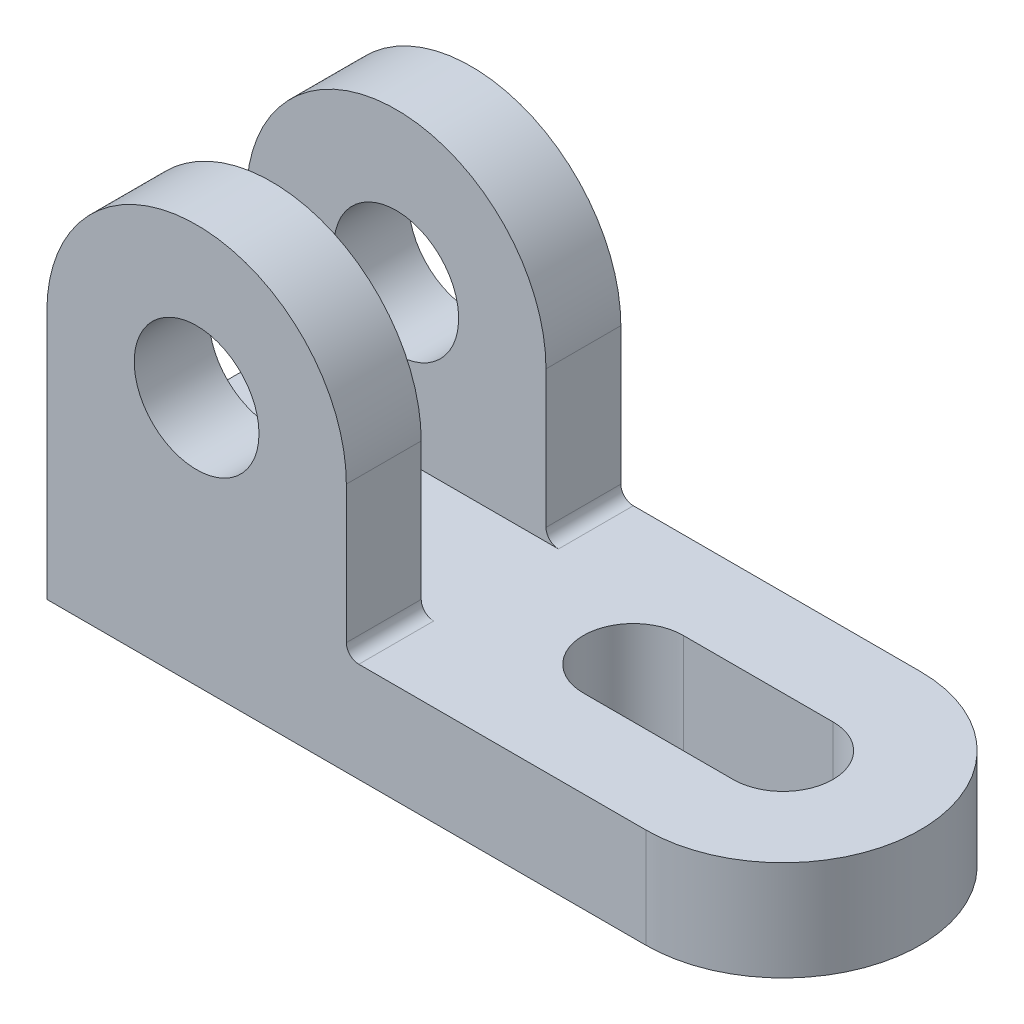
ISO-10303-21;
HEADER;
FILE_DESCRIPTION(('STEP AP214'),'2;1');
FILE_NAME('part.step','',(''),(''),'','','');
FILE_SCHEMA(('AUTOMOTIVE_DESIGN { 1 0 10303 214 1 1 1 1 }'));
ENDSEC;
DATA;
#1=APPLICATION_CONTEXT('core data for automotive mechanical design processes');
#2=APPLICATION_PROTOCOL_DEFINITION('international standard','automotive_design',2000,#1);
#3=PRODUCT_CONTEXT('',#1,'mechanical');
#4=PRODUCT('Part','Part','',(#3));
#5=PRODUCT_RELATED_PRODUCT_CATEGORY('part','',(#4));
#6=PRODUCT_DEFINITION_FORMATION('','',#4);
#7=PRODUCT_DEFINITION_CONTEXT('part definition',#1,'design');
#8=PRODUCT_DEFINITION('design','',#6,#7);
#9=PRODUCT_DEFINITION_SHAPE('','',#8);
#10=(LENGTH_UNIT() NAMED_UNIT(*) SI_UNIT(.MILLI.,.METRE.));
#11=(NAMED_UNIT(*) PLANE_ANGLE_UNIT() SI_UNIT($,.RADIAN.));
#12=(NAMED_UNIT(*) SI_UNIT($,.STERADIAN.) SOLID_ANGLE_UNIT());
#13=UNCERTAINTY_MEASURE_WITH_UNIT(LENGTH_MEASURE(1.E-05),#10,'distance_accuracy_value','');
#14=(GEOMETRIC_REPRESENTATION_CONTEXT(3) GLOBAL_UNCERTAINTY_ASSIGNED_CONTEXT((#13)) GLOBAL_UNIT_ASSIGNED_CONTEXT((#10,
#11,#12)) REPRESENTATION_CONTEXT('',''));
#15=CARTESIAN_POINT('',(0.,0.,0.));
#16=DIRECTION('',(0.,0.,1.));
#17=DIRECTION('',(1.,0.,0.));
#18=AXIS2_PLACEMENT_3D('',#15,#16,#17);
#19=CARTESIAN_POINT('',(48.,16.,0.));
#20=DIRECTION('',(0.,-1.,0.));
#21=DIRECTION('',(0.,0.,-1.));
#22=AXIS2_PLACEMENT_3D('',#19,#20,#21);
#23=CYLINDRICAL_SURFACE('',#22,22.);
#24=CARTESIAN_POINT('',(48.,0.,0.));
#25=DIRECTION('',(0.,1.,0.));
#26=DIRECTION('',(0.,0.,1.));
#27=AXIS2_PLACEMENT_3D('',#24,#25,#26);
#28=CIRCLE('',#27,22.);
#29=CARTESIAN_POINT('',(48.,0.,22.));
#30=VERTEX_POINT('',#29);
#31=CARTESIAN_POINT('',(48.,0.,-22.));
#32=VERTEX_POINT('',#31);
#33=EDGE_CURVE('E300',#30,#32,#28,.T.);
#34=ORIENTED_EDGE('',*,*,#33,.T.);
#35=DIRECTION('',(0.,-1.,0.));
#36=VECTOR('',#35,1.);
#37=CARTESIAN_POINT('',(48.,16.,-22.));
#38=LINE('',#37,#36);
#39=CARTESIAN_POINT('',(48.,16.,-22.));
#40=VERTEX_POINT('',#39);
#41=EDGE_CURVE('E11',#40,#32,#38,.T.);
#42=ORIENTED_EDGE('',*,*,#41,.F.);
#43=CARTESIAN_POINT('',(48.,16.,0.));
#44=DIRECTION('',(0.,1.,0.));
#45=DIRECTION('',(0.,0.,1.));
#46=AXIS2_PLACEMENT_3D('',#43,#44,#45);
#47=CIRCLE('',#46,22.);
#48=CARTESIAN_POINT('',(48.,16.,22.));
#49=VERTEX_POINT('',#48);
#50=EDGE_CURVE('E310',#49,#40,#47,.T.);
#51=ORIENTED_EDGE('',*,*,#50,.F.);
#52=DIRECTION('',(0.,-1.,0.));
#53=VECTOR('',#52,1.);
#54=CARTESIAN_POINT('',(48.,16.,22.));
#55=LINE('',#54,#53);
#56=EDGE_CURVE('E323',#49,#30,#55,.T.);
#57=ORIENTED_EDGE('',*,*,#56,.T.);
#58=EDGE_LOOP('',(#34,#42,#51,#57));
#59=FACE_BOUND('',#58,.T.);
#60=ADVANCED_FACE('F45',(#59),#23,.T.);
#61=CARTESIAN_POINT('',(-48.,16.,-22.));
#62=DIRECTION('',(0.,0.,1.));
#63=DIRECTION('',(1.,0.,0.));
#64=AXIS2_PLACEMENT_3D('',#61,#62,#63);
#65=PLANE('',#64);
#66=DIRECTION('',(-1.,0.,0.));
#67=VECTOR('',#66,1.);
#68=CARTESIAN_POINT('',(-48.,0.,-22.));
#69=LINE('',#68,#67);
#70=CARTESIAN_POINT('',(-48.,0.,-22.));
#71=VERTEX_POINT('',#70);
#72=EDGE_CURVE('E327',#32,#71,#69,.T.);
#73=ORIENTED_EDGE('',*,*,#72,.T.);
#74=DIRECTION('',(0.,-1.,0.));
#75=VECTOR('',#74,1.);
#76=CARTESIAN_POINT('',(-48.,16.,-22.));
#77=LINE('',#76,#75);
#78=CARTESIAN_POINT('',(-48.,40.,-22.));
#79=VERTEX_POINT('',#78);
#80=EDGE_CURVE('E53',#79,#71,#77,.T.);
#81=ORIENTED_EDGE('',*,*,#80,.F.);
#82=CARTESIAN_POINT('',(-24.,40.,-22.));
#83=DIRECTION('',(0.,0.,-1.));
#84=DIRECTION('',(-1.,0.,0.));
#85=AXIS2_PLACEMENT_3D('',#82,#83,#84);
#86=CIRCLE('',#85,24.);
#87=CARTESIAN_POINT('',(0.,40.,-22.));
#88=VERTEX_POINT('',#87);
#89=EDGE_CURVE('E163',#79,#88,#86,.T.);
#90=ORIENTED_EDGE('',*,*,#89,.T.);
#91=DIRECTION('',(0.,-1.,0.));
#92=VECTOR('',#91,1.);
#93=CARTESIAN_POINT('',(0.,0.,-22.));
#94=LINE('',#93,#92);
#95=CARTESIAN_POINT('',(0.,18.,-22.));
#96=VERTEX_POINT('',#95);
#97=EDGE_CURVE('E200',#88,#96,#94,.T.);
#98=ORIENTED_EDGE('',*,*,#97,.T.);
#99=CARTESIAN_POINT('',(2.,18.,-22.));
#100=DIRECTION('',(0.,0.,-1.));
#101=DIRECTION('',(-1.,0.,0.));
#102=AXIS2_PLACEMENT_3D('',#99,#100,#101);
#103=CIRCLE('',#102,2.);
#104=CARTESIAN_POINT('',(1.99999999999999,16.,-22.));
#105=VERTEX_POINT('',#104);
#106=EDGE_CURVE('E194',#105,#96,#103,.T.);
#107=ORIENTED_EDGE('',*,*,#106,.F.);
#108=DIRECTION('',(-1.,0.,0.));
#109=VECTOR('',#108,1.);
#110=CARTESIAN_POINT('',(-48.,16.,-22.));
#111=LINE('',#110,#109);
#112=EDGE_CURVE('E314',#40,#105,#111,.T.);
#113=ORIENTED_EDGE('',*,*,#112,.F.);
#114=ORIENTED_EDGE('',*,*,#41,.T.);
#115=EDGE_LOOP('',(#73,#81,#90,#98,#107,#113,#114));
#116=FACE_BOUND('',#115,.T.);
#117=CARTESIAN_POINT('',(-24.,40.,-22.));
#118=DIRECTION('',(0.,0.,-1.));
#119=DIRECTION('',(-1.,0.,0.));
#120=AXIS2_PLACEMENT_3D('',#117,#118,#119);
#121=CIRCLE('',#120,10.);
#122=CARTESIAN_POINT('',(-34.,40.,-22.));
#123=VERTEX_POINT('',#122);
#124=EDGE_CURVE('E190',#123,#123,#121,.T.);
#125=ORIENTED_EDGE('',*,*,#124,.F.);
#126=EDGE_LOOP('',(#125));
#127=FACE_BOUND('',#126,.T.);
#128=ADVANCED_FACE('F389',(#116,#127),#65,.F.);
#129=CARTESIAN_POINT('',(-48.,16.,-22.));
#130=DIRECTION('',(1.,0.,0.));
#131=DIRECTION('',(0.,0.,-1.));
#132=AXIS2_PLACEMENT_3D('',#129,#130,#131);
#133=PLANE('',#132);
#134=DIRECTION('',(0.,0.,1.));
#135=VECTOR('',#134,1.);
#136=CARTESIAN_POINT('',(-48.,0.,-22.));
#137=LINE('',#136,#135);
#138=CARTESIAN_POINT('',(-48.,0.,22.));
#139=VERTEX_POINT('',#138);
#140=EDGE_CURVE('E330',#71,#139,#137,.T.);
#141=ORIENTED_EDGE('',*,*,#140,.T.);
#142=DIRECTION('',(0.,-1.,0.));
#143=VECTOR('',#142,1.);
#144=CARTESIAN_POINT('',(-48.,16.,22.));
#145=LINE('',#144,#143);
#146=CARTESIAN_POINT('',(-48.,40.,22.));
#147=VERTEX_POINT('',#146);
#148=EDGE_CURVE('E338',#147,#139,#145,.T.);
#149=ORIENTED_EDGE('',*,*,#148,.F.);
#150=DIRECTION('',(0.,0.,1.));
#151=VECTOR('',#150,1.);
#152=CARTESIAN_POINT('',(-48.,40.,9.99999999999999));
#153=LINE('',#152,#151);
#154=CARTESIAN_POINT('',(-48.,40.,9.99999999999999));
#155=VERTEX_POINT('',#154);
#156=EDGE_CURVE('E252',#155,#147,#153,.T.);
#157=ORIENTED_EDGE('',*,*,#156,.F.);
#158=DIRECTION('',(0.,1.,0.));
#159=VECTOR('',#158,1.);
#160=CARTESIAN_POINT('',(-48.,0.,9.99999999999999));
#161=LINE('',#160,#159);
#162=CARTESIAN_POINT('',(-48.,16.,10.));
#163=VERTEX_POINT('',#162);
#164=EDGE_CURVE('E234',#163,#155,#161,.T.);
#165=ORIENTED_EDGE('',*,*,#164,.F.);
#166=DIRECTION('',(0.,0.,1.));
#167=VECTOR('',#166,1.);
#168=CARTESIAN_POINT('',(-48.,16.,-22.));
#169=LINE('',#168,#167);
#170=CARTESIAN_POINT('',(-48.,16.,-10.));
#171=VERTEX_POINT('',#170);
#172=EDGE_CURVE('E180',#171,#163,#169,.T.);
#173=ORIENTED_EDGE('',*,*,#172,.F.);
#174=DIRECTION('',(0.,1.,0.));
#175=VECTOR('',#174,1.);
#176=CARTESIAN_POINT('',(-48.,0.,-10.));
#177=LINE('',#176,#175);
#178=CARTESIAN_POINT('',(-48.,40.,-10.));
#179=VERTEX_POINT('',#178);
#180=EDGE_CURVE('E173',#171,#179,#177,.T.);
#181=ORIENTED_EDGE('',*,*,#180,.T.);
#182=DIRECTION('',(0.,0.,-1.));
#183=VECTOR('',#182,1.);
#184=CARTESIAN_POINT('',(-48.,40.,-10.));
#185=LINE('',#184,#183);
#186=EDGE_CURVE('E157',#179,#79,#185,.T.);
#187=ORIENTED_EDGE('',*,*,#186,.T.);
#188=ORIENTED_EDGE('',*,*,#80,.T.);
#189=EDGE_LOOP('',(#141,#149,#157,#165,#173,#181,#187,#188));
#190=FACE_BOUND('',#189,.T.);
#191=ADVANCED_FACE('F178',(#190),#133,.F.);
#192=CARTESIAN_POINT('',(-48.,16.,22.));
#193=DIRECTION('',(0.,0.,-1.));
#194=DIRECTION('',(-1.,0.,0.));
#195=AXIS2_PLACEMENT_3D('',#192,#193,#194);
#196=PLANE('',#195);
#197=DIRECTION('',(1.,0.,0.));
#198=VECTOR('',#197,1.);
#199=CARTESIAN_POINT('',(-48.,0.,22.));
#200=LINE('',#199,#198);
#201=EDGE_CURVE('E315',#139,#30,#200,.T.);
#202=ORIENTED_EDGE('',*,*,#201,.T.);
#203=ORIENTED_EDGE('',*,*,#56,.F.);
#204=DIRECTION('',(1.,0.,0.));
#205=VECTOR('',#204,1.);
#206=CARTESIAN_POINT('',(-48.,16.,22.));
#207=LINE('',#206,#205);
#208=CARTESIAN_POINT('',(2.,16.,22.));
#209=VERTEX_POINT('',#208);
#210=EDGE_CURVE('E320',#209,#49,#207,.T.);
#211=ORIENTED_EDGE('',*,*,#210,.F.);
#212=CARTESIAN_POINT('',(2.,18.,22.));
#213=DIRECTION('',(0.,0.,1.));
#214=DIRECTION('',(1.,0.,0.));
#215=AXIS2_PLACEMENT_3D('',#212,#213,#214);
#216=CIRCLE('',#215,2.);
#217=CARTESIAN_POINT('',(0.,18.,22.));
#218=VERTEX_POINT('',#217);
#219=EDGE_CURVE('E241',#209,#218,#216,.F.);
#220=ORIENTED_EDGE('',*,*,#219,.T.);
#221=DIRECTION('',(0.,1.,0.));
#222=VECTOR('',#221,1.);
#223=CARTESIAN_POINT('',(0.,0.,22.));
#224=LINE('',#223,#222);
#225=CARTESIAN_POINT('',(0.,40.,22.));
#226=VERTEX_POINT('',#225);
#227=EDGE_CURVE('E245',#218,#226,#224,.T.);
#228=ORIENTED_EDGE('',*,*,#227,.T.);
#229=CARTESIAN_POINT('',(-24.,40.,22.));
#230=DIRECTION('',(0.,0.,1.));
#231=DIRECTION('',(1.,0.,0.));
#232=AXIS2_PLACEMENT_3D('',#229,#230,#231);
#233=CIRCLE('',#232,24.);
#234=EDGE_CURVE('E218',#226,#147,#233,.T.);
#235=ORIENTED_EDGE('',*,*,#234,.T.);
#236=ORIENTED_EDGE('',*,*,#148,.T.);
#237=EDGE_LOOP('',(#202,#203,#211,#220,#228,#235,#236));
#238=FACE_BOUND('',#237,.T.);
#239=CARTESIAN_POINT('',(-24.,40.,22.));
#240=DIRECTION('',(0.,0.,1.));
#241=DIRECTION('',(1.,0.,0.));
#242=AXIS2_PLACEMENT_3D('',#239,#240,#241);
#243=CIRCLE('',#242,10.);
#244=CARTESIAN_POINT('',(-14.,40.,22.));
#245=VERTEX_POINT('',#244);
#246=EDGE_CURVE('E208',#245,#245,#243,.T.);
#247=ORIENTED_EDGE('',*,*,#246,.F.);
#248=EDGE_LOOP('',(#247));
#249=FACE_BOUND('',#248,.T.);
#250=ADVANCED_FACE('F350',(#238,#249),#196,.F.);
#251=CARTESIAN_POINT('',(48.,16.,0.));
#252=DIRECTION('',(0.,1.,0.));
#253=DIRECTION('',(0.,0.,1.));
#254=AXIS2_PLACEMENT_3D('',#251,#252,#253);
#255=PLANE('',#254);
#256=DIRECTION('',(0.,0.,-1.));
#257=VECTOR('',#256,1.);
#258=CARTESIAN_POINT('',(2.,16.,-10.));
#259=LINE('',#258,#257);
#260=CARTESIAN_POINT('',(1.99999999999999,16.,-10.));
#261=VERTEX_POINT('',#260);
#262=EDGE_CURVE('E60',#261,#105,#259,.T.);
#263=ORIENTED_EDGE('',*,*,#262,.F.);
#264=DIRECTION('',(1.,0.,0.));
#265=VECTOR('',#264,1.);
#266=CARTESIAN_POINT('',(0.,16.,-10.));
#267=LINE('',#266,#265);
#268=EDGE_CURVE('E64',#171,#261,#267,.T.);
#269=ORIENTED_EDGE('',*,*,#268,.F.);
#270=ORIENTED_EDGE('',*,*,#172,.T.);
#271=DIRECTION('',(-1.,0.,0.));
#272=VECTOR('',#271,1.);
#273=CARTESIAN_POINT('',(0.,16.,9.99999999999999));
#274=LINE('',#273,#272);
#275=CARTESIAN_POINT('',(1.99999999999999,16.,9.99999999999999));
#276=VERTEX_POINT('',#275);
#277=EDGE_CURVE('E217',#276,#163,#274,.T.);
#278=ORIENTED_EDGE('',*,*,#277,.F.);
#279=DIRECTION('',(0.,0.,1.));
#280=VECTOR('',#279,1.);
#281=CARTESIAN_POINT('',(2.,16.,9.99999999999999));
#282=LINE('',#281,#280);
#283=EDGE_CURVE('E237',#276,#209,#282,.T.);
#284=ORIENTED_EDGE('',*,*,#283,.T.);
#285=ORIENTED_EDGE('',*,*,#210,.T.);
#286=ORIENTED_EDGE('',*,*,#50,.T.);
#287=ORIENTED_EDGE('',*,*,#112,.T.);
#288=EDGE_LOOP('',(#263,#269,#270,#278,#284,#285,#286,#287));
#289=FACE_BOUND('',#288,.T.);
#290=CARTESIAN_POINT('',(48.,16.,0.));
#291=DIRECTION('',(0.,1.,0.));
#292=DIRECTION('',(0.,0.,1.));
#293=AXIS2_PLACEMENT_3D('',#290,#291,#292);
#294=CIRCLE('',#293,8.);
#295=CARTESIAN_POINT('',(48.,16.,8.));
#296=VERTEX_POINT('',#295);
#297=CARTESIAN_POINT('',(48.,16.,-8.));
#298=VERTEX_POINT('',#297);
#299=EDGE_CURVE('E256',#296,#298,#294,.T.);
#300=ORIENTED_EDGE('',*,*,#299,.F.);
#301=DIRECTION('',(1.,0.,0.));
#302=VECTOR('',#301,1.);
#303=CARTESIAN_POINT('',(48.,16.,8.));
#304=LINE('',#303,#302);
#305=CARTESIAN_POINT('',(24.,16.,8.00000000000001));
#306=VERTEX_POINT('',#305);
#307=EDGE_CURVE('E271',#306,#296,#304,.T.);
#308=ORIENTED_EDGE('',*,*,#307,.F.);
#309=CARTESIAN_POINT('',(24.,16.,0.));
#310=DIRECTION('',(0.,1.,0.));
#311=DIRECTION('',(0.,0.,1.));
#312=AXIS2_PLACEMENT_3D('',#309,#310,#311);
#313=CIRCLE('',#312,8.);
#314=CARTESIAN_POINT('',(24.,16.,-8.));
#315=VERTEX_POINT('',#314);
#316=EDGE_CURVE('E290',#315,#306,#313,.T.);
#317=ORIENTED_EDGE('',*,*,#316,.F.);
#318=DIRECTION('',(-1.,0.,0.));
#319=VECTOR('',#318,1.);
#320=CARTESIAN_POINT('',(48.,16.,-8.));
#321=LINE('',#320,#319);
#322=EDGE_CURVE('E286',#298,#315,#321,.T.);
#323=ORIENTED_EDGE('',*,*,#322,.F.);
#324=EDGE_LOOP('',(#300,#308,#317,#323));
#325=FACE_BOUND('',#324,.T.);
#326=ADVANCED_FACE('F355',(#289,#325),#255,.T.);
#327=CARTESIAN_POINT('',(48.,0.,0.));
#328=DIRECTION('',(0.,1.,0.));
#329=DIRECTION('',(0.,0.,1.));
#330=AXIS2_PLACEMENT_3D('',#327,#328,#329);
#331=PLANE('',#330);
#332=DIRECTION('',(1.,0.,0.));
#333=VECTOR('',#332,1.);
#334=CARTESIAN_POINT('',(48.,0.,8.));
#335=LINE('',#334,#333);
#336=CARTESIAN_POINT('',(24.,0.,8.00000000000001));
#337=VERTEX_POINT('',#336);
#338=CARTESIAN_POINT('',(48.,0.,8.));
#339=VERTEX_POINT('',#338);
#340=EDGE_CURVE('E279',#337,#339,#335,.T.);
#341=ORIENTED_EDGE('',*,*,#340,.T.);
#342=CARTESIAN_POINT('',(48.,0.,0.));
#343=DIRECTION('',(0.,1.,0.));
#344=DIRECTION('',(0.,0.,1.));
#345=AXIS2_PLACEMENT_3D('',#342,#343,#344);
#346=CIRCLE('',#345,8.);
#347=CARTESIAN_POINT('',(48.,0.,-8.));
#348=VERTEX_POINT('',#347);
#349=EDGE_CURVE('E266',#339,#348,#346,.T.);
#350=ORIENTED_EDGE('',*,*,#349,.T.);
#351=DIRECTION('',(-1.,0.,0.));
#352=VECTOR('',#351,1.);
#353=CARTESIAN_POINT('',(48.,0.,-8.));
#354=LINE('',#353,#352);
#355=CARTESIAN_POINT('',(24.,0.,-8.));
#356=VERTEX_POINT('',#355);
#357=EDGE_CURVE('E270',#348,#356,#354,.T.);
#358=ORIENTED_EDGE('',*,*,#357,.T.);
#359=CARTESIAN_POINT('',(24.,0.,0.));
#360=DIRECTION('',(0.,1.,0.));
#361=DIRECTION('',(0.,0.,1.));
#362=AXIS2_PLACEMENT_3D('',#359,#360,#361);
#363=CIRCLE('',#362,8.);
#364=EDGE_CURVE('E275',#356,#337,#363,.T.);
#365=ORIENTED_EDGE('',*,*,#364,.T.);
#366=EDGE_LOOP('',(#341,#350,#358,#365));
#367=FACE_BOUND('',#366,.T.);
#368=ORIENTED_EDGE('',*,*,#33,.F.);
#369=ORIENTED_EDGE('',*,*,#201,.F.);
#370=ORIENTED_EDGE('',*,*,#140,.F.);
#371=ORIENTED_EDGE('',*,*,#72,.F.);
#372=EDGE_LOOP('',(#368,#369,#370,#371));
#373=FACE_BOUND('',#372,.T.);
#374=ADVANCED_FACE('F347',(#367,#373),#331,.F.);
#375=CARTESIAN_POINT('',(48.,0.,0.));
#376=DIRECTION('',(0.,1.,0.));
#377=DIRECTION('',(0.,0.,1.));
#378=AXIS2_PLACEMENT_3D('',#375,#376,#377);
#379=CYLINDRICAL_SURFACE('',#378,8.);
#380=ORIENTED_EDGE('',*,*,#299,.T.);
#381=DIRECTION('',(0.,1.,0.));
#382=VECTOR('',#381,1.);
#383=CARTESIAN_POINT('',(48.,0.,-8.));
#384=LINE('',#383,#382);
#385=EDGE_CURVE('E283',#348,#298,#384,.T.);
#386=ORIENTED_EDGE('',*,*,#385,.F.);
#387=ORIENTED_EDGE('',*,*,#349,.F.);
#388=DIRECTION('',(0.,1.,0.));
#389=VECTOR('',#388,1.);
#390=CARTESIAN_POINT('',(48.,0.,8.));
#391=LINE('',#390,#389);
#392=EDGE_CURVE('E297',#339,#296,#391,.T.);
#393=ORIENTED_EDGE('',*,*,#392,.T.);
#394=EDGE_LOOP('',(#380,#386,#387,#393));
#395=FACE_BOUND('',#394,.T.);
#396=ADVANCED_FACE('F403',(#395),#379,.F.);
#397=CARTESIAN_POINT('',(48.,0.,8.));
#398=DIRECTION('',(0.,0.,1.));
#399=DIRECTION('',(1.,0.,0.));
#400=AXIS2_PLACEMENT_3D('',#397,#398,#399);
#401=PLANE('',#400);
#402=ORIENTED_EDGE('',*,*,#307,.T.);
#403=ORIENTED_EDGE('',*,*,#392,.F.);
#404=ORIENTED_EDGE('',*,*,#340,.F.);
#405=DIRECTION('',(0.,1.,0.));
#406=VECTOR('',#405,1.);
#407=CARTESIAN_POINT('',(24.,0.,8.00000000000001));
#408=LINE('',#407,#406);
#409=EDGE_CURVE('E301',#337,#306,#408,.T.);
#410=ORIENTED_EDGE('',*,*,#409,.T.);
#411=EDGE_LOOP('',(#402,#403,#404,#410));
#412=FACE_BOUND('',#411,.T.);
#413=ADVANCED_FACE('F409',(#412),#401,.F.);
#414=CARTESIAN_POINT('',(24.,0.,0.));
#415=DIRECTION('',(0.,1.,0.));
#416=DIRECTION('',(0.,0.,1.));
#417=AXIS2_PLACEMENT_3D('',#414,#415,#416);
#418=CYLINDRICAL_SURFACE('',#417,8.);
#419=ORIENTED_EDGE('',*,*,#316,.T.);
#420=ORIENTED_EDGE('',*,*,#409,.F.);
#421=ORIENTED_EDGE('',*,*,#364,.F.);
#422=DIRECTION('',(0.,1.,0.));
#423=VECTOR('',#422,1.);
#424=CARTESIAN_POINT('',(24.,0.,-8.));
#425=LINE('',#424,#423);
#426=EDGE_CURVE('E304',#356,#315,#425,.T.);
#427=ORIENTED_EDGE('',*,*,#426,.T.);
#428=EDGE_LOOP('',(#419,#420,#421,#427));
#429=FACE_BOUND('',#428,.T.);
#430=ADVANCED_FACE('F414',(#429),#418,.F.);
#431=CARTESIAN_POINT('',(48.,0.,-8.));
#432=DIRECTION('',(0.,0.,-1.));
#433=DIRECTION('',(-1.,0.,0.));
#434=AXIS2_PLACEMENT_3D('',#431,#432,#433);
#435=PLANE('',#434);
#436=ORIENTED_EDGE('',*,*,#322,.T.);
#437=ORIENTED_EDGE('',*,*,#426,.F.);
#438=ORIENTED_EDGE('',*,*,#357,.F.);
#439=ORIENTED_EDGE('',*,*,#385,.T.);
#440=EDGE_LOOP('',(#436,#437,#438,#439));
#441=FACE_BOUND('',#440,.T.);
#442=ADVANCED_FACE('F411',(#441),#435,.F.);
#443=CARTESIAN_POINT('',(-24.,40.,9.99999999999999));
#444=DIRECTION('',(0.,0.,1.));
#445=DIRECTION('',(1.,0.,0.));
#446=AXIS2_PLACEMENT_3D('',#443,#444,#445);
#447=CYLINDRICAL_SURFACE('',#446,24.);
#448=ORIENTED_EDGE('',*,*,#234,.F.);
#449=DIRECTION('',(0.,0.,1.));
#450=VECTOR('',#449,1.);
#451=CARTESIAN_POINT('',(0.,40.,9.99999999999999));
#452=LINE('',#451,#450);
#453=CARTESIAN_POINT('',(0.,40.,9.99999999999999));
#454=VERTEX_POINT('',#453);
#455=EDGE_CURVE('E257',#454,#226,#452,.T.);
#456=ORIENTED_EDGE('',*,*,#455,.F.);
#457=CARTESIAN_POINT('',(-24.,40.,9.99999999999999));
#458=DIRECTION('',(0.,0.,1.));
#459=DIRECTION('',(1.,0.,0.));
#460=AXIS2_PLACEMENT_3D('',#457,#458,#459);
#461=CIRCLE('',#460,24.);
#462=EDGE_CURVE('E230',#454,#155,#461,.T.);
#463=ORIENTED_EDGE('',*,*,#462,.T.);
#464=ORIENTED_EDGE('',*,*,#156,.T.);
#465=EDGE_LOOP('',(#448,#456,#463,#464));
#466=FACE_BOUND('',#465,.T.);
#467=ADVANCED_FACE('F369',(#466),#447,.T.);
#468=CARTESIAN_POINT('',(0.,0.,9.99999999999999));
#469=DIRECTION('',(1.,0.,0.));
#470=DIRECTION('',(0.,1.,0.));
#471=AXIS2_PLACEMENT_3D('',#468,#469,#470);
#472=PLANE('',#471);
#473=ORIENTED_EDGE('',*,*,#227,.F.);
#474=DIRECTION('',(0.,0.,1.));
#475=VECTOR('',#474,1.);
#476=CARTESIAN_POINT('',(0.,18.,9.99999999999999));
#477=LINE('',#476,#475);
#478=CARTESIAN_POINT('',(0.,18.,9.99999999999999));
#479=VERTEX_POINT('',#478);
#480=EDGE_CURVE('E260',#479,#218,#477,.T.);
#481=ORIENTED_EDGE('',*,*,#480,.F.);
#482=DIRECTION('',(0.,1.,0.));
#483=VECTOR('',#482,1.);
#484=CARTESIAN_POINT('',(0.,0.,9.99999999999999));
#485=LINE('',#484,#483);
#486=EDGE_CURVE('E226',#479,#454,#485,.T.);
#487=ORIENTED_EDGE('',*,*,#486,.T.);
#488=ORIENTED_EDGE('',*,*,#455,.T.);
#489=EDGE_LOOP('',(#473,#481,#487,#488));
#490=FACE_BOUND('',#489,.T.);
#491=ADVANCED_FACE('F365',(#490),#472,.T.);
#492=CARTESIAN_POINT('',(-24.,40.,9.99999999999999));
#493=DIRECTION('',(0.,0.,1.));
#494=DIRECTION('',(1.,0.,0.));
#495=AXIS2_PLACEMENT_3D('',#492,#493,#494);
#496=CYLINDRICAL_SURFACE('',#495,10.);
#497=CARTESIAN_POINT('',(-24.,40.,9.99999999999999));
#498=DIRECTION('',(0.,0.,1.));
#499=DIRECTION('',(1.,0.,0.));
#500=AXIS2_PLACEMENT_3D('',#497,#498,#499);
#501=CIRCLE('',#500,10.);
#502=CARTESIAN_POINT('',(-14.,40.,9.99999999999999));
#503=VERTEX_POINT('',#502);
#504=EDGE_CURVE('E213',#503,#503,#501,.T.);
#505=ORIENTED_EDGE('',*,*,#504,.F.);
#506=EDGE_LOOP('',(#505));
#507=FACE_BOUND('',#506,.T.);
#508=ORIENTED_EDGE('',*,*,#246,.T.);
#509=EDGE_LOOP('',(#508));
#510=FACE_BOUND('',#509,.T.);
#511=ADVANCED_FACE('F384',(#507,#510),#496,.F.);
#512=CARTESIAN_POINT('',(2.,18.,9.99999999999999));
#513=DIRECTION('',(0.,0.,1.));
#514=DIRECTION('',(1.,0.,0.));
#515=AXIS2_PLACEMENT_3D('',#512,#513,#514);
#516=CYLINDRICAL_SURFACE('',#515,2.);
#517=ORIENTED_EDGE('',*,*,#219,.F.);
#518=ORIENTED_EDGE('',*,*,#283,.F.);
#519=CARTESIAN_POINT('',(2.,18.,9.99999999999999));
#520=DIRECTION('',(0.,0.,1.));
#521=DIRECTION('',(1.,0.,0.));
#522=AXIS2_PLACEMENT_3D('',#519,#520,#521);
#523=CIRCLE('',#522,2.);
#524=EDGE_CURVE('E222',#276,#479,#523,.F.);
#525=ORIENTED_EDGE('',*,*,#524,.T.);
#526=ORIENTED_EDGE('',*,*,#480,.T.);
#527=EDGE_LOOP('',(#517,#518,#525,#526));
#528=FACE_BOUND('',#527,.T.);
#529=ADVANCED_FACE('F361',(#528),#516,.F.);
#530=CARTESIAN_POINT('',(0.,0.,9.99999999999999));
#531=DIRECTION('',(0.,0.,1.));
#532=DIRECTION('',(1.,0.,0.));
#533=AXIS2_PLACEMENT_3D('',#530,#531,#532);
#534=PLANE('',#533);
#535=ORIENTED_EDGE('',*,*,#504,.T.);
#536=EDGE_LOOP('',(#535));
#537=FACE_BOUND('',#536,.T.);
#538=ORIENTED_EDGE('',*,*,#277,.T.);
#539=ORIENTED_EDGE('',*,*,#164,.T.);
#540=ORIENTED_EDGE('',*,*,#462,.F.);
#541=ORIENTED_EDGE('',*,*,#486,.F.);
#542=ORIENTED_EDGE('',*,*,#524,.F.);
#543=EDGE_LOOP('',(#538,#539,#540,#541,#542));
#544=FACE_BOUND('',#543,.T.);
#545=ADVANCED_FACE('F372',(#537,#544),#534,.F.);
#546=CARTESIAN_POINT('',(2.,18.,-10.));
#547=DIRECTION('',(0.,0.,-1.));
#548=DIRECTION('',(-1.,0.,0.));
#549=AXIS2_PLACEMENT_3D('',#546,#547,#548);
#550=CYLINDRICAL_SURFACE('',#549,2.);
#551=ORIENTED_EDGE('',*,*,#106,.T.);
#552=DIRECTION('',(0.,0.,-1.));
#553=VECTOR('',#552,1.);
#554=CARTESIAN_POINT('',(0.,18.,-10.));
#555=LINE('',#554,#553);
#556=CARTESIAN_POINT('',(0.,18.,-10.));
#557=VERTEX_POINT('',#556);
#558=EDGE_CURVE('E205',#557,#96,#555,.T.);
#559=ORIENTED_EDGE('',*,*,#558,.F.);
#560=CARTESIAN_POINT('',(2.,18.,-10.));
#561=DIRECTION('',(0.,0.,-1.));
#562=DIRECTION('',(-1.,0.,0.));
#563=AXIS2_PLACEMENT_3D('',#560,#561,#562);
#564=CIRCLE('',#563,2.);
#565=EDGE_CURVE('E184',#261,#557,#564,.T.);
#566=ORIENTED_EDGE('',*,*,#565,.F.);
#567=ORIENTED_EDGE('',*,*,#262,.T.);
#568=EDGE_LOOP('',(#551,#559,#566,#567));
#569=FACE_BOUND('',#568,.T.);
#570=ADVANCED_FACE('F374',(#569),#550,.F.);
#571=CARTESIAN_POINT('',(0.,0.,-10.));
#572=DIRECTION('',(1.,0.,0.));
#573=DIRECTION('',(0.,1.,0.));
#574=AXIS2_PLACEMENT_3D('',#571,#572,#573);
#575=PLANE('',#574);
#576=ORIENTED_EDGE('',*,*,#97,.F.);
#577=DIRECTION('',(0.,0.,-1.));
#578=VECTOR('',#577,1.);
#579=CARTESIAN_POINT('',(0.,40.,-10.));
#580=LINE('',#579,#578);
#581=CARTESIAN_POINT('',(0.,40.,-10.));
#582=VERTEX_POINT('',#581);
#583=EDGE_CURVE('E168',#582,#88,#580,.T.);
#584=ORIENTED_EDGE('',*,*,#583,.F.);
#585=DIRECTION('',(0.,-1.,0.));
#586=VECTOR('',#585,1.);
#587=CARTESIAN_POINT('',(0.,0.,-10.));
#588=LINE('',#587,#586);
#589=EDGE_CURVE('E175',#582,#557,#588,.T.);
#590=ORIENTED_EDGE('',*,*,#589,.T.);
#591=ORIENTED_EDGE('',*,*,#558,.T.);
#592=EDGE_LOOP('',(#576,#584,#590,#591));
#593=FACE_BOUND('',#592,.T.);
#594=ADVANCED_FACE('F381',(#593),#575,.T.);
#595=CARTESIAN_POINT('',(-24.,40.,-10.));
#596=DIRECTION('',(0.,0.,-1.));
#597=DIRECTION('',(-1.,0.,0.));
#598=AXIS2_PLACEMENT_3D('',#595,#596,#597);
#599=CYLINDRICAL_SURFACE('',#598,24.);
#600=ORIENTED_EDGE('',*,*,#89,.F.);
#601=ORIENTED_EDGE('',*,*,#186,.F.);
#602=CARTESIAN_POINT('',(-24.,40.,-10.));
#603=DIRECTION('',(0.,0.,-1.));
#604=DIRECTION('',(-1.,0.,0.));
#605=AXIS2_PLACEMENT_3D('',#602,#603,#604);
#606=CIRCLE('',#605,24.);
#607=EDGE_CURVE('E160',#179,#582,#606,.T.);
#608=ORIENTED_EDGE('',*,*,#607,.T.);
#609=ORIENTED_EDGE('',*,*,#583,.T.);
#610=EDGE_LOOP('',(#600,#601,#608,#609));
#611=FACE_BOUND('',#610,.T.);
#612=ADVANCED_FACE('F159',(#611),#599,.T.);
#613=CARTESIAN_POINT('',(-24.,40.,-10.));
#614=DIRECTION('',(0.,0.,-1.));
#615=DIRECTION('',(-1.,0.,0.));
#616=AXIS2_PLACEMENT_3D('',#613,#614,#615);
#617=CYLINDRICAL_SURFACE('',#616,10.);
#618=CARTESIAN_POINT('',(-24.,40.,-10.));
#619=DIRECTION('',(0.,0.,-1.));
#620=DIRECTION('',(-1.,0.,0.));
#621=AXIS2_PLACEMENT_3D('',#618,#619,#620);
#622=CIRCLE('',#621,10.);
#623=CARTESIAN_POINT('',(-34.,40.,-10.));
#624=VERTEX_POINT('',#623);
#625=EDGE_CURVE('E204',#624,#624,#622,.T.);
#626=ORIENTED_EDGE('',*,*,#625,.F.);
#627=EDGE_LOOP('',(#626));
#628=FACE_BOUND('',#627,.T.);
#629=ORIENTED_EDGE('',*,*,#124,.T.);
#630=EDGE_LOOP('',(#629));
#631=FACE_BOUND('',#630,.T.);
#632=ADVANCED_FACE('F497',(#628,#631),#617,.F.);
#633=CARTESIAN_POINT('',(0.,0.,-10.));
#634=DIRECTION('',(0.,0.,-1.));
#635=DIRECTION('',(-1.,0.,0.));
#636=AXIS2_PLACEMENT_3D('',#633,#634,#635);
#637=PLANE('',#636);
#638=ORIENTED_EDGE('',*,*,#625,.T.);
#639=EDGE_LOOP('',(#638));
#640=FACE_BOUND('',#639,.T.);
#641=ORIENTED_EDGE('',*,*,#565,.T.);
#642=ORIENTED_EDGE('',*,*,#589,.F.);
#643=ORIENTED_EDGE('',*,*,#607,.F.);
#644=ORIENTED_EDGE('',*,*,#180,.F.);
#645=ORIENTED_EDGE('',*,*,#268,.T.);
#646=EDGE_LOOP('',(#641,#642,#643,#644,#645));
#647=FACE_BOUND('',#646,.T.);
#648=ADVANCED_FACE('F172',(#640,#647),#637,.F.);
#649=CLOSED_SHELL('',(#60,#128,#191,#250,#326,#374,#396,#413,#430,#442,#467,#491,#511,#529,#545,
#570,#594,#612,#632,#648));
#650=MANIFOLD_SOLID_BREP('B2',#649);
#651=ADVANCED_BREP_SHAPE_REPRESENTATION('',(#18,#650),#14);
#652=SHAPE_DEFINITION_REPRESENTATION(#9,#651);
ENDSEC;
END-ISO-10303-21;
